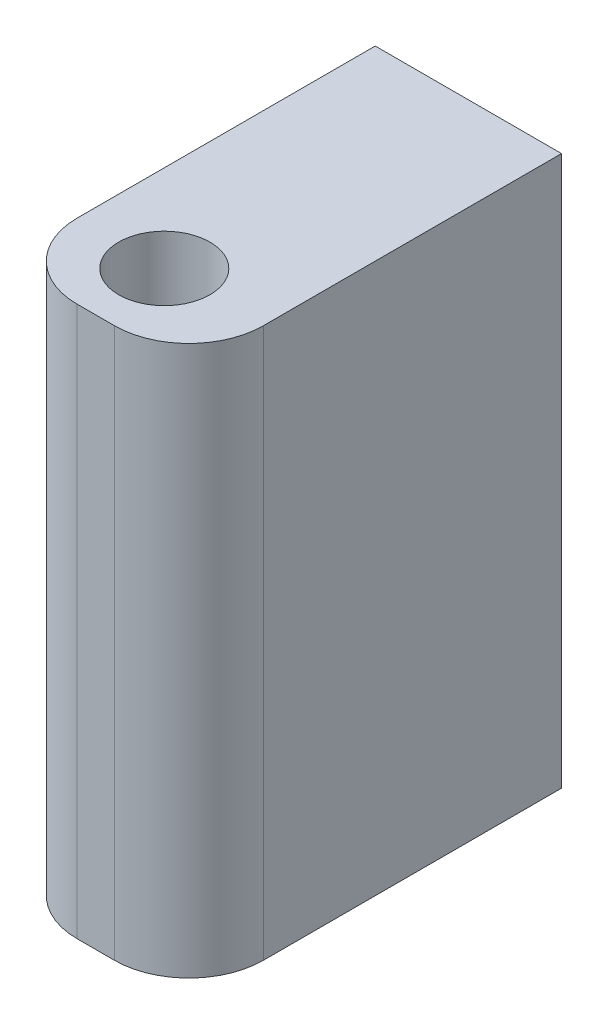
ISO-10303-21;
HEADER;
FILE_DESCRIPTION(('STEP AP214'),'2;1');
FILE_NAME('part.step','',(''),(''),'','','');
FILE_SCHEMA(('AUTOMOTIVE_DESIGN { 1 0 10303 214 1 1 1 1 }'));
ENDSEC;
DATA;
#1=APPLICATION_CONTEXT('core data for automotive mechanical design processes');
#2=APPLICATION_PROTOCOL_DEFINITION('international standard','automotive_design',2000,#1);
#3=PRODUCT_CONTEXT('',#1,'mechanical');
#4=PRODUCT('Part','Part','',(#3));
#5=PRODUCT_RELATED_PRODUCT_CATEGORY('part','',(#4));
#6=PRODUCT_DEFINITION_FORMATION('','',#4);
#7=PRODUCT_DEFINITION_CONTEXT('part definition',#1,'design');
#8=PRODUCT_DEFINITION('design','',#6,#7);
#9=PRODUCT_DEFINITION_SHAPE('','',#8);
#10=(LENGTH_UNIT() NAMED_UNIT(*) SI_UNIT(.MILLI.,.METRE.));
#11=(NAMED_UNIT(*) PLANE_ANGLE_UNIT() SI_UNIT($,.RADIAN.));
#12=(NAMED_UNIT(*) SI_UNIT($,.STERADIAN.) SOLID_ANGLE_UNIT());
#13=UNCERTAINTY_MEASURE_WITH_UNIT(LENGTH_MEASURE(1.E-05),#10,'distance_accuracy_value','');
#14=(GEOMETRIC_REPRESENTATION_CONTEXT(3) GLOBAL_UNCERTAINTY_ASSIGNED_CONTEXT((#13)) GLOBAL_UNIT_ASSIGNED_CONTEXT((#10,
#11,#12)) REPRESENTATION_CONTEXT('',''));
#15=CARTESIAN_POINT('',(0.,0.,0.));
#16=DIRECTION('',(0.,0.,1.));
#17=DIRECTION('',(1.,0.,0.));
#18=AXIS2_PLACEMENT_3D('',#15,#16,#17);
#19=CARTESIAN_POINT('',(-4.67798079652414,-13.5851542825568,0.));
#20=DIRECTION('',(0.,0.,1.));
#21=DIRECTION('',(1.,0.,0.));
#22=AXIS2_PLACEMENT_3D('',#19,#20,#21);
#23=PLANE('',#22);
#24=CARTESIAN_POINT('',(0.,7.9148457174432,0.));
#25=DIRECTION('',(0.,0.,1.));
#26=DIRECTION('',(1.,0.,0.));
#27=AXIS2_PLACEMENT_3D('',#24,#25,#26);
#28=CIRCLE('',#27,1.95);
#29=CARTESIAN_POINT('',(1.95,7.9148457174432,0.));
#30=VERTEX_POINT('',#29);
#31=EDGE_CURVE('E184',#30,#30,#28,.T.);
#32=ORIENTED_EDGE('',*,*,#31,.T.);
#33=EDGE_LOOP('',(#32));
#34=FACE_BOUND('',#33,.T.);
#35=DIRECTION('',(0.,-1.,0.));
#36=VECTOR('',#35,1.);
#37=CARTESIAN_POINT('',(-4.67798079652415,15.9148457174432,0.));
#38=LINE('',#37,#36);
#39=CARTESIAN_POINT('',(-4.67798079652415,15.9148457174432,0.));
#40=VERTEX_POINT('',#39);
#41=CARTESIAN_POINT('',(-4.67798079652414,-13.5851542825568,0.));
#42=VERTEX_POINT('',#41);
#43=EDGE_CURVE('E98',#40,#42,#38,.T.);
#44=ORIENTED_EDGE('',*,*,#43,.F.);
#45=DIRECTION('',(-1.,0.,0.));
#46=VECTOR('',#45,1.);
#47=CARTESIAN_POINT('',(-4.67798079652415,15.9148457174432,0.));
#48=LINE('',#47,#46);
#49=CARTESIAN_POINT('',(5.32201920347585,15.9148457174432,0.));
#50=VERTEX_POINT('',#49);
#51=EDGE_CURVE('E115',#50,#40,#48,.T.);
#52=ORIENTED_EDGE('',*,*,#51,.F.);
#53=DIRECTION('',(0.,1.,0.));
#54=VECTOR('',#53,1.);
#55=CARTESIAN_POINT('',(5.32201920347585,15.9148457174432,0.));
#56=LINE('',#55,#54);
#57=CARTESIAN_POINT('',(5.32201920347586,-13.5851542825568,0.));
#58=VERTEX_POINT('',#57);
#59=EDGE_CURVE('E100',#58,#50,#56,.T.);
#60=ORIENTED_EDGE('',*,*,#59,.F.);
#61=DIRECTION('',(1.,0.,0.));
#62=VECTOR('',#61,1.);
#63=CARTESIAN_POINT('',(-4.67798079652414,-13.5851542825568,0.));
#64=LINE('',#63,#62);
#65=EDGE_CURVE('E87',#42,#58,#64,.T.);
#66=ORIENTED_EDGE('',*,*,#65,.F.);
#67=EDGE_LOOP('',(#44,#52,#60,#66));
#68=FACE_BOUND('',#67,.T.);
#69=CARTESIAN_POINT('',(0.,-7.0851542825568,0.));
#70=DIRECTION('',(0.,0.,1.));
#71=DIRECTION('',(1.,0.,0.));
#72=AXIS2_PLACEMENT_3D('',#69,#70,#71);
#73=CIRCLE('',#72,1.95);
#74=CARTESIAN_POINT('',(1.95,-7.0851542825568,0.));
#75=VERTEX_POINT('',#74);
#76=EDGE_CURVE('E191',#75,#75,#73,.T.);
#77=ORIENTED_EDGE('',*,*,#76,.T.);
#78=EDGE_LOOP('',(#77));
#79=FACE_BOUND('',#78,.T.);
#80=ADVANCED_FACE('F30',(#34,#68,#79),#23,.F.);
#81=CARTESIAN_POINT('',(-4.67798079652415,15.9148457174432,20.));
#82=DIRECTION('',(1.,0.,0.));
#83=DIRECTION('',(0.,1.,0.));
#84=AXIS2_PLACEMENT_3D('',#81,#82,#83);
#85=PLANE('',#84);
#86=DIRECTION('',(0.,0.,-1.));
#87=VECTOR('',#86,1.);
#88=CARTESIAN_POINT('',(-4.67798079652414,-13.5851542825568,20.));
#89=LINE('',#88,#87);
#90=CARTESIAN_POINT('',(-4.67798079652414,-13.5851542825568,16.));
#91=VERTEX_POINT('',#90);
#92=EDGE_CURVE('E82',#91,#42,#89,.T.);
#93=ORIENTED_EDGE('',*,*,#92,.F.);
#94=DIRECTION('',(0.,-1.,0.));
#95=VECTOR('',#94,1.);
#96=CARTESIAN_POINT('',(-4.67798079652415,15.9148457174432,16.));
#97=LINE('',#96,#95);
#98=CARTESIAN_POINT('',(-4.67798079652415,15.9148457174432,16.));
#99=VERTEX_POINT('',#98);
#100=EDGE_CURVE('E53',#91,#99,#97,.F.);
#101=ORIENTED_EDGE('',*,*,#100,.T.);
#102=DIRECTION('',(0.,0.,-1.));
#103=VECTOR('',#102,1.);
#104=CARTESIAN_POINT('',(-4.67798079652415,15.9148457174432,20.));
#105=LINE('',#104,#103);
#106=EDGE_CURVE('E103',#99,#40,#105,.T.);
#107=ORIENTED_EDGE('',*,*,#106,.T.);
#108=ORIENTED_EDGE('',*,*,#43,.T.);
#109=EDGE_LOOP('',(#93,#101,#107,#108));
#110=FACE_BOUND('',#109,.T.);
#111=ADVANCED_FACE('F102',(#110),#85,.F.);
#112=CARTESIAN_POINT('',(-4.67798079652414,-13.5851542825568,20.));
#113=DIRECTION('',(0.,1.,0.));
#114=DIRECTION('',(0.,0.,1.));
#115=AXIS2_PLACEMENT_3D('',#112,#113,#114);
#116=PLANE('',#115);
#117=CARTESIAN_POINT('',(0.,-13.5851542825568,16.));
#118=DIRECTION('',(0.,1.,0.));
#119=DIRECTION('',(0.,0.,1.));
#120=AXIS2_PLACEMENT_3D('',#117,#118,#119);
#121=CIRCLE('',#120,2.45);
#122=CARTESIAN_POINT('',(0.,-13.5851542825568,18.45));
#123=VERTEX_POINT('',#122);
#124=EDGE_CURVE('E105',#123,#123,#121,.T.);
#125=ORIENTED_EDGE('',*,*,#124,.T.);
#126=EDGE_LOOP('',(#125));
#127=FACE_BOUND('',#126,.T.);
#128=DIRECTION('',(1.,0.,0.));
#129=VECTOR('',#128,1.);
#130=CARTESIAN_POINT('',(-4.67798079652414,-13.5851542825568,20.));
#131=LINE('',#130,#129);
#132=CARTESIAN_POINT('',(-0.677980796524142,-13.5851542825568,20.));
#133=VERTEX_POINT('',#132);
#134=CARTESIAN_POINT('',(1.32201920347586,-13.5851542825568,20.));
#135=VERTEX_POINT('',#134);
#136=EDGE_CURVE('E117',#133,#135,#131,.T.);
#137=ORIENTED_EDGE('',*,*,#136,.F.);
#138=CARTESIAN_POINT('',(-0.677980796524142,-13.5851542825568,16.));
#139=DIRECTION('',(0.,1.,0.));
#140=DIRECTION('',(0.,0.,1.));
#141=AXIS2_PLACEMENT_3D('',#138,#139,#140);
#142=CIRCLE('',#141,4.);
#143=EDGE_CURVE('E89',#133,#91,#142,.F.);
#144=ORIENTED_EDGE('',*,*,#143,.T.);
#145=ORIENTED_EDGE('',*,*,#92,.T.);
#146=ORIENTED_EDGE('',*,*,#65,.T.);
#147=DIRECTION('',(0.,0.,-1.));
#148=VECTOR('',#147,1.);
#149=CARTESIAN_POINT('',(5.32201920347586,-13.5851542825568,20.));
#150=LINE('',#149,#148);
#151=CARTESIAN_POINT('',(5.32201920347586,-13.5851542825568,16.));
#152=VERTEX_POINT('',#151);
#153=EDGE_CURVE('E92',#152,#58,#150,.T.);
#154=ORIENTED_EDGE('',*,*,#153,.F.);
#155=CARTESIAN_POINT('',(1.32201920347586,-13.5851542825568,16.));
#156=DIRECTION('',(0.,1.,0.));
#157=DIRECTION('',(0.,0.,1.));
#158=AXIS2_PLACEMENT_3D('',#155,#156,#157);
#159=CIRCLE('',#158,4.);
#160=EDGE_CURVE('E127',#152,#135,#159,.F.);
#161=ORIENTED_EDGE('',*,*,#160,.T.);
#162=EDGE_LOOP('',(#137,#144,#145,#146,#154,#161));
#163=FACE_BOUND('',#162,.T.);
#164=ADVANCED_FACE('F85',(#127,#163),#116,.F.);
#165=CARTESIAN_POINT('',(5.32201920347585,15.9148457174432,20.));
#166=DIRECTION('',(-1.,0.,0.));
#167=DIRECTION('',(0.,-1.,0.));
#168=AXIS2_PLACEMENT_3D('',#165,#166,#167);
#169=PLANE('',#168);
#170=DIRECTION('',(0.,0.,-1.));
#171=VECTOR('',#170,1.);
#172=CARTESIAN_POINT('',(5.32201920347585,15.9148457174432,20.));
#173=LINE('',#172,#171);
#174=CARTESIAN_POINT('',(5.32201920347585,15.9148457174432,16.));
#175=VERTEX_POINT('',#174);
#176=EDGE_CURVE('E119',#175,#50,#173,.T.);
#177=ORIENTED_EDGE('',*,*,#176,.F.);
#178=DIRECTION('',(0.,1.,0.));
#179=VECTOR('',#178,1.);
#180=CARTESIAN_POINT('',(5.32201920347586,-13.5851542825568,16.));
#181=LINE('',#180,#179);
#182=EDGE_CURVE('E11',#175,#152,#181,.F.);
#183=ORIENTED_EDGE('',*,*,#182,.T.);
#184=ORIENTED_EDGE('',*,*,#153,.T.);
#185=ORIENTED_EDGE('',*,*,#59,.T.);
#186=EDGE_LOOP('',(#177,#183,#184,#185));
#187=FACE_BOUND('',#186,.T.);
#188=ADVANCED_FACE('F164',(#187),#169,.F.);
#189=CARTESIAN_POINT('',(-4.67798079652415,15.9148457174432,20.));
#190=DIRECTION('',(0.,-1.,0.));
#191=DIRECTION('',(0.,0.,-1.));
#192=AXIS2_PLACEMENT_3D('',#189,#190,#191);
#193=PLANE('',#192);
#194=CARTESIAN_POINT('',(0.,15.9148457174432,16.));
#195=DIRECTION('',(0.,1.,0.));
#196=DIRECTION('',(0.,0.,1.));
#197=AXIS2_PLACEMENT_3D('',#194,#195,#196);
#198=CIRCLE('',#197,2.45);
#199=CARTESIAN_POINT('',(0.,15.9148457174432,18.45));
#200=VERTEX_POINT('',#199);
#201=EDGE_CURVE('E108',#200,#200,#198,.T.);
#202=ORIENTED_EDGE('',*,*,#201,.F.);
#203=EDGE_LOOP('',(#202));
#204=FACE_BOUND('',#203,.T.);
#205=ORIENTED_EDGE('',*,*,#106,.F.);
#206=CARTESIAN_POINT('',(-0.677980796524146,15.9148457174432,16.));
#207=DIRECTION('',(0.,-1.,0.));
#208=DIRECTION('',(0.,0.,-1.));
#209=AXIS2_PLACEMENT_3D('',#206,#207,#208);
#210=CIRCLE('',#209,4.);
#211=CARTESIAN_POINT('',(-0.677980796524146,15.9148457174432,20.));
#212=VERTEX_POINT('',#211);
#213=EDGE_CURVE('E38',#99,#212,#210,.F.);
#214=ORIENTED_EDGE('',*,*,#213,.T.);
#215=DIRECTION('',(-1.,0.,0.));
#216=VECTOR('',#215,1.);
#217=CARTESIAN_POINT('',(-4.67798079652415,15.9148457174432,20.));
#218=LINE('',#217,#216);
#219=CARTESIAN_POINT('',(1.32201920347585,15.9148457174432,20.));
#220=VERTEX_POINT('',#219);
#221=EDGE_CURVE('E111',#220,#212,#218,.T.);
#222=ORIENTED_EDGE('',*,*,#221,.F.);
#223=CARTESIAN_POINT('',(1.32201920347585,15.9148457174432,16.));
#224=DIRECTION('',(0.,-1.,0.));
#225=DIRECTION('',(0.,0.,-1.));
#226=AXIS2_PLACEMENT_3D('',#223,#224,#225);
#227=CIRCLE('',#226,4.);
#228=EDGE_CURVE('E45',#220,#175,#227,.F.);
#229=ORIENTED_EDGE('',*,*,#228,.T.);
#230=ORIENTED_EDGE('',*,*,#176,.T.);
#231=ORIENTED_EDGE('',*,*,#51,.T.);
#232=EDGE_LOOP('',(#205,#214,#222,#229,#230,#231));
#233=FACE_BOUND('',#232,.T.);
#234=ADVANCED_FACE('F133',(#204,#233),#193,.F.);
#235=CARTESIAN_POINT('',(-4.67798079652414,-13.5851542825568,20.));
#236=DIRECTION('',(0.,0.,1.));
#237=DIRECTION('',(1.,0.,0.));
#238=AXIS2_PLACEMENT_3D('',#235,#236,#237);
#239=PLANE('',#238);
#240=ORIENTED_EDGE('',*,*,#221,.T.);
#241=DIRECTION('',(0.,-1.,0.));
#242=VECTOR('',#241,1.);
#243=CARTESIAN_POINT('',(-0.677980796524142,-13.5851542825568,20.));
#244=LINE('',#243,#242);
#245=EDGE_CURVE('E124',#212,#133,#244,.T.);
#246=ORIENTED_EDGE('',*,*,#245,.T.);
#247=ORIENTED_EDGE('',*,*,#136,.T.);
#248=DIRECTION('',(0.,1.,0.));
#249=VECTOR('',#248,1.);
#250=CARTESIAN_POINT('',(1.32201920347585,15.9148457174432,20.));
#251=LINE('',#250,#249);
#252=EDGE_CURVE('E91',#135,#220,#251,.T.);
#253=ORIENTED_EDGE('',*,*,#252,.T.);
#254=EDGE_LOOP('',(#240,#246,#247,#253));
#255=FACE_BOUND('',#254,.T.);
#256=ADVANCED_FACE('F137',(#255),#239,.T.);
#257=CARTESIAN_POINT('',(0.,-13.5851542825568,16.));
#258=DIRECTION('',(0.,1.,0.));
#259=DIRECTION('',(0.,0.,1.));
#260=AXIS2_PLACEMENT_3D('',#257,#258,#259);
#261=CYLINDRICAL_SURFACE('',#260,2.45);
#262=ORIENTED_EDGE('',*,*,#124,.F.);
#263=EDGE_LOOP('',(#262));
#264=FACE_BOUND('',#263,.T.);
#265=ORIENTED_EDGE('',*,*,#201,.T.);
#266=EDGE_LOOP('',(#265));
#267=FACE_BOUND('',#266,.T.);
#268=ADVANCED_FACE('F175',(#264,#267),#261,.F.);
#269=CARTESIAN_POINT('',(0.,7.9148457174432,11.));
#270=DIRECTION('',(0.,0.,-1.));
#271=DIRECTION('',(-1.,0.,0.));
#272=AXIS2_PLACEMENT_3D('',#269,#270,#271);
#273=CYLINDRICAL_SURFACE('',#272,1.95);
#274=CARTESIAN_POINT('',(0.,7.9148457174432,11.));
#275=DIRECTION('',(0.,0.,1.));
#276=DIRECTION('',(1.,0.,0.));
#277=AXIS2_PLACEMENT_3D('',#274,#275,#276);
#278=CIRCLE('',#277,1.95);
#279=CARTESIAN_POINT('',(1.95,7.9148457174432,11.));
#280=VERTEX_POINT('',#279);
#281=EDGE_CURVE('E181',#280,#280,#278,.T.);
#282=ORIENTED_EDGE('',*,*,#281,.T.);
#283=EDGE_LOOP('',(#282));
#284=FACE_BOUND('',#283,.T.);
#285=ORIENTED_EDGE('',*,*,#31,.F.);
#286=EDGE_LOOP('',(#285));
#287=FACE_BOUND('',#286,.T.);
#288=ADVANCED_FACE('F178',(#284,#287),#273,.F.);
#289=CARTESIAN_POINT('',(0.,7.9148457174432,11.));
#290=DIRECTION('',(0.,0.,1.));
#291=DIRECTION('',(1.,0.,0.));
#292=AXIS2_PLACEMENT_3D('',#289,#290,#291);
#293=PLANE('',#292);
#294=ORIENTED_EDGE('',*,*,#281,.F.);
#295=EDGE_LOOP('',(#294));
#296=FACE_BOUND('',#295,.T.);
#297=ADVANCED_FACE('F199',(#296),#293,.F.);
#298=CARTESIAN_POINT('',(0.,-7.0851542825568,11.));
#299=DIRECTION('',(0.,0.,-1.));
#300=DIRECTION('',(-1.,0.,0.));
#301=AXIS2_PLACEMENT_3D('',#298,#299,#300);
#302=CYLINDRICAL_SURFACE('',#301,1.95);
#303=CARTESIAN_POINT('',(0.,-7.0851542825568,11.));
#304=DIRECTION('',(0.,0.,1.));
#305=DIRECTION('',(1.,0.,0.));
#306=AXIS2_PLACEMENT_3D('',#303,#304,#305);
#307=CIRCLE('',#306,1.95);
#308=CARTESIAN_POINT('',(1.95,-7.0851542825568,11.));
#309=VERTEX_POINT('',#308);
#310=EDGE_CURVE('E189',#309,#309,#307,.T.);
#311=ORIENTED_EDGE('',*,*,#310,.T.);
#312=EDGE_LOOP('',(#311));
#313=FACE_BOUND('',#312,.T.);
#314=ORIENTED_EDGE('',*,*,#76,.F.);
#315=EDGE_LOOP('',(#314));
#316=FACE_BOUND('',#315,.T.);
#317=ADVANCED_FACE('F148',(#313,#316),#302,.F.);
#318=CARTESIAN_POINT('',(0.,-7.0851542825568,11.));
#319=DIRECTION('',(0.,0.,1.));
#320=DIRECTION('',(1.,0.,0.));
#321=AXIS2_PLACEMENT_3D('',#318,#319,#320);
#322=PLANE('',#321);
#323=ORIENTED_EDGE('',*,*,#310,.F.);
#324=EDGE_LOOP('',(#323));
#325=FACE_BOUND('',#324,.T.);
#326=ADVANCED_FACE('F142',(#325),#322,.F.);
#327=CARTESIAN_POINT('',(-0.677980796524142,-13.5851542825568,16.));
#328=DIRECTION('',(0.,1.,0.));
#329=DIRECTION('',(-1.,0.,0.));
#330=AXIS2_PLACEMENT_3D('',#327,#328,#329);
#331=CYLINDRICAL_SURFACE('',#330,4.);
#332=ORIENTED_EDGE('',*,*,#213,.F.);
#333=ORIENTED_EDGE('',*,*,#100,.F.);
#334=ORIENTED_EDGE('',*,*,#143,.F.);
#335=ORIENTED_EDGE('',*,*,#245,.F.);
#336=EDGE_LOOP('',(#332,#333,#334,#335));
#337=FACE_BOUND('',#336,.T.);
#338=ADVANCED_FACE('F140',(#337),#331,.T.);
#339=CARTESIAN_POINT('',(1.32201920347586,-13.5851542825568,16.));
#340=DIRECTION('',(0.,-1.,0.));
#341=DIRECTION('',(1.,0.,0.));
#342=AXIS2_PLACEMENT_3D('',#339,#340,#341);
#343=CYLINDRICAL_SURFACE('',#342,4.);
#344=ORIENTED_EDGE('',*,*,#160,.F.);
#345=ORIENTED_EDGE('',*,*,#182,.F.);
#346=ORIENTED_EDGE('',*,*,#228,.F.);
#347=ORIENTED_EDGE('',*,*,#252,.F.);
#348=EDGE_LOOP('',(#344,#345,#346,#347));
#349=FACE_BOUND('',#348,.T.);
#350=ADVANCED_FACE('F32',(#349),#343,.T.);
#351=CLOSED_SHELL('',(#80,#111,#164,#188,#234,#256,#268,#288,#297,#317,#326,#338,#350));
#352=MANIFOLD_SOLID_BREP('B2',#351);
#353=ADVANCED_BREP_SHAPE_REPRESENTATION('',(#18,#352),#14);
#354=SHAPE_DEFINITION_REPRESENTATION(#9,#353);
ENDSEC;
END-ISO-10303-21;
